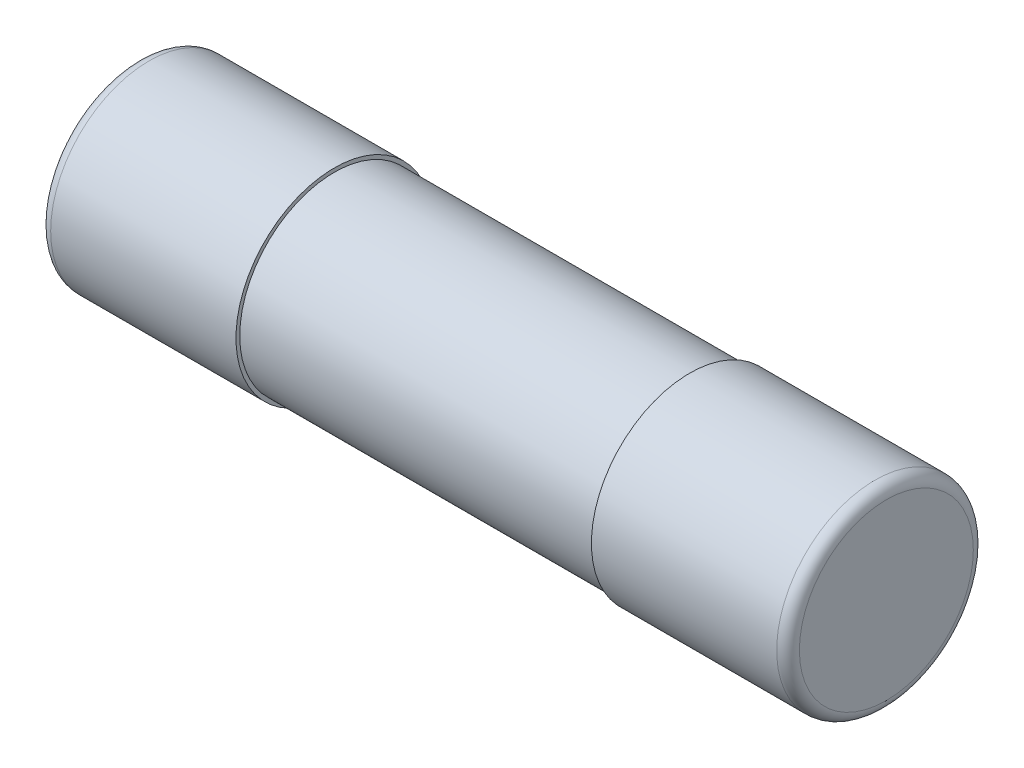
ISO-10303-21;
HEADER;
FILE_DESCRIPTION(('STEP AP214'),'2;1');
FILE_NAME('part.step','',(''),(''),'','','');
FILE_SCHEMA(('AUTOMOTIVE_DESIGN { 1 0 10303 214 1 1 1 1 }'));
ENDSEC;
DATA;
#1=APPLICATION_CONTEXT('core data for automotive mechanical design processes');
#2=APPLICATION_PROTOCOL_DEFINITION('international standard','automotive_design',2000,#1);
#3=PRODUCT_CONTEXT('',#1,'mechanical');
#4=PRODUCT('Part','Part','',(#3));
#5=PRODUCT_RELATED_PRODUCT_CATEGORY('part','',(#4));
#6=PRODUCT_DEFINITION_FORMATION('','',#4);
#7=PRODUCT_DEFINITION_CONTEXT('part definition',#1,'design');
#8=PRODUCT_DEFINITION('design','',#6,#7);
#9=PRODUCT_DEFINITION_SHAPE('','',#8);
#10=(LENGTH_UNIT() NAMED_UNIT(*) SI_UNIT(.MILLI.,.METRE.));
#11=(NAMED_UNIT(*) PLANE_ANGLE_UNIT() SI_UNIT($,.RADIAN.));
#12=(NAMED_UNIT(*) SI_UNIT($,.STERADIAN.) SOLID_ANGLE_UNIT());
#13=UNCERTAINTY_MEASURE_WITH_UNIT(LENGTH_MEASURE(1.E-05),#10,'distance_accuracy_value','');
#14=(GEOMETRIC_REPRESENTATION_CONTEXT(3) GLOBAL_UNCERTAINTY_ASSIGNED_CONTEXT((#13)) GLOBAL_UNIT_ASSIGNED_CONTEXT((#10,
#11,#12)) REPRESENTATION_CONTEXT('',''));
#15=CARTESIAN_POINT('',(0.,0.,0.));
#16=DIRECTION('',(0.,0.,1.));
#17=DIRECTION('',(1.,0.,0.));
#18=AXIS2_PLACEMENT_3D('',#15,#16,#17);
#19=CARTESIAN_POINT('',(4.7,0.,0.));
#20=DIRECTION('',(-1.,0.,0.));
#21=DIRECTION('',(0.,0.,1.));
#22=AXIS2_PLACEMENT_3D('',#19,#20,#21);
#23=CYLINDRICAL_SURFACE('',#22,2.5);
#24=CARTESIAN_POINT('',(4.7,0.,0.));
#25=DIRECTION('',(1.,0.,0.));
#26=DIRECTION('',(0.,0.,-1.));
#27=AXIS2_PLACEMENT_3D('',#24,#25,#26);
#28=CIRCLE('',#27,2.5);
#29=CARTESIAN_POINT('',(4.7,0.,-2.5));
#30=VERTEX_POINT('',#29);
#31=EDGE_CURVE('E50',#30,#30,#28,.T.);
#32=ORIENTED_EDGE('',*,*,#31,.F.);
#33=EDGE_LOOP('',(#32));
#34=FACE_BOUND('',#33,.T.);
#35=CARTESIAN_POINT('',(-4.7,0.,0.));
#36=DIRECTION('',(-1.,0.,0.));
#37=DIRECTION('',(0.,0.,1.));
#38=AXIS2_PLACEMENT_3D('',#35,#36,#37);
#39=CIRCLE('',#38,2.5);
#40=CARTESIAN_POINT('',(-4.7,0.,2.5));
#41=VERTEX_POINT('',#40);
#42=EDGE_CURVE('E56',#41,#41,#39,.T.);
#43=ORIENTED_EDGE('',*,*,#42,.F.);
#44=EDGE_LOOP('',(#43));
#45=FACE_BOUND('',#44,.T.);
#46=ADVANCED_FACE('F30',(#34,#45),#23,.T.);
#47=CARTESIAN_POINT('',(4.7,0.,0.));
#48=DIRECTION('',(1.,0.,0.));
#49=DIRECTION('',(0.,0.,-1.));
#50=AXIS2_PLACEMENT_3D('',#47,#48,#49);
#51=PLANE('',#50);
#52=CARTESIAN_POINT('',(4.7,0.,0.));
#53=DIRECTION('',(1.,0.,0.));
#54=DIRECTION('',(0.,0.,-1.));
#55=AXIS2_PLACEMENT_3D('',#52,#53,#54);
#56=CIRCLE('',#55,2.6);
#57=CARTESIAN_POINT('',(4.7,0.,-2.6));
#58=VERTEX_POINT('',#57);
#59=EDGE_CURVE('E53',#58,#58,#56,.T.);
#60=ORIENTED_EDGE('',*,*,#59,.F.);
#61=EDGE_LOOP('',(#60));
#62=FACE_BOUND('',#61,.T.);
#63=ORIENTED_EDGE('',*,*,#31,.T.);
#64=EDGE_LOOP('',(#63));
#65=FACE_BOUND('',#64,.T.);
#66=ADVANCED_FACE('F79',(#62,#65),#51,.F.);
#67=CARTESIAN_POINT('',(9.9,0.,0.));
#68=DIRECTION('',(-1.,0.,0.));
#69=DIRECTION('',(0.,0.,1.));
#70=AXIS2_PLACEMENT_3D('',#67,#68,#69);
#71=CYLINDRICAL_SURFACE('',#70,2.6);
#72=CARTESIAN_POINT('',(9.6,0.,0.));
#73=DIRECTION('',(1.,0.,0.));
#74=DIRECTION('',(0.,0.,-1.));
#75=AXIS2_PLACEMENT_3D('',#72,#73,#74);
#76=CIRCLE('',#75,2.6);
#77=CARTESIAN_POINT('',(9.6,0.,-2.6));
#78=VERTEX_POINT('',#77);
#79=EDGE_CURVE('E41',#78,#78,#76,.F.);
#80=ORIENTED_EDGE('',*,*,#79,.T.);
#81=EDGE_LOOP('',(#80));
#82=FACE_BOUND('',#81,.T.);
#83=ORIENTED_EDGE('',*,*,#59,.T.);
#84=EDGE_LOOP('',(#83));
#85=FACE_BOUND('',#84,.T.);
#86=ADVANCED_FACE('F85',(#82,#85),#71,.T.);
#87=CARTESIAN_POINT('',(9.9,0.,0.));
#88=DIRECTION('',(1.,0.,0.));
#89=DIRECTION('',(0.,0.,-1.));
#90=AXIS2_PLACEMENT_3D('',#87,#88,#89);
#91=PLANE('',#90);
#92=CARTESIAN_POINT('',(9.9,0.,0.));
#93=DIRECTION('',(1.,0.,0.));
#94=DIRECTION('',(0.,0.,-1.));
#95=AXIS2_PLACEMENT_3D('',#92,#93,#94);
#96=CIRCLE('',#95,2.3);
#97=CARTESIAN_POINT('',(9.9,0.,-2.3));
#98=VERTEX_POINT('',#97);
#99=EDGE_CURVE('E45',#98,#98,#96,.T.);
#100=ORIENTED_EDGE('',*,*,#99,.T.);
#101=EDGE_LOOP('',(#100));
#102=FACE_BOUND('',#101,.T.);
#103=ADVANCED_FACE('F92',(#102),#91,.T.);
#104=CARTESIAN_POINT('',(9.6,0.,0.));
#105=DIRECTION('',(1.,0.,0.));
#106=DIRECTION('',(0.,0.,-1.));
#107=AXIS2_PLACEMENT_3D('',#104,#105,#106);
#108=TOROIDAL_SURFACE('',#107,2.3,0.3);
#109=ORIENTED_EDGE('',*,*,#79,.F.);
#110=EDGE_LOOP('',(#109));
#111=FACE_BOUND('',#110,.T.);
#112=ORIENTED_EDGE('',*,*,#99,.F.);
#113=EDGE_LOOP('',(#112));
#114=FACE_BOUND('',#113,.T.);
#115=ADVANCED_FACE('F75',(#111,#114),#108,.T.);
#116=CARTESIAN_POINT('',(-4.7,0.,0.));
#117=DIRECTION('',(-1.,0.,0.));
#118=DIRECTION('',(0.,0.,-1.));
#119=AXIS2_PLACEMENT_3D('',#116,#117,#118);
#120=PLANE('',#119);
#121=CARTESIAN_POINT('',(-4.7,0.,0.));
#122=DIRECTION('',(1.,0.,0.));
#123=DIRECTION('',(0.,0.,-1.));
#124=AXIS2_PLACEMENT_3D('',#121,#122,#123);
#125=CIRCLE('',#124,2.6);
#126=CARTESIAN_POINT('',(-4.7,0.,-2.6));
#127=VERTEX_POINT('',#126);
#128=EDGE_CURVE('E59',#127,#127,#125,.T.);
#129=ORIENTED_EDGE('',*,*,#128,.T.);
#130=EDGE_LOOP('',(#129));
#131=FACE_BOUND('',#130,.T.);
#132=ORIENTED_EDGE('',*,*,#42,.T.);
#133=EDGE_LOOP('',(#132));
#134=FACE_BOUND('',#133,.T.);
#135=ADVANCED_FACE('F63',(#131,#134),#120,.F.);
#136=CARTESIAN_POINT('',(-9.9,0.,0.));
#137=DIRECTION('',(1.,0.,0.));
#138=DIRECTION('',(0.,0.,-1.));
#139=AXIS2_PLACEMENT_3D('',#136,#137,#138);
#140=CYLINDRICAL_SURFACE('',#139,2.6);
#141=CARTESIAN_POINT('',(-9.6,0.,0.));
#142=DIRECTION('',(-1.,0.,0.));
#143=DIRECTION('',(0.,0.,1.));
#144=AXIS2_PLACEMENT_3D('',#141,#142,#143);
#145=CIRCLE('',#144,2.6);
#146=CARTESIAN_POINT('',(-9.6,0.,2.6));
#147=VERTEX_POINT('',#146);
#148=EDGE_CURVE('E37',#147,#147,#145,.F.);
#149=ORIENTED_EDGE('',*,*,#148,.T.);
#150=EDGE_LOOP('',(#149));
#151=FACE_BOUND('',#150,.T.);
#152=ORIENTED_EDGE('',*,*,#128,.F.);
#153=EDGE_LOOP('',(#152));
#154=FACE_BOUND('',#153,.T.);
#155=ADVANCED_FACE('F66',(#151,#154),#140,.T.);
#156=CARTESIAN_POINT('',(-9.9,0.,0.));
#157=DIRECTION('',(-1.,0.,0.));
#158=DIRECTION('',(0.,0.,-1.));
#159=AXIS2_PLACEMENT_3D('',#156,#157,#158);
#160=PLANE('',#159);
#161=CARTESIAN_POINT('',(-9.9,0.,0.));
#162=DIRECTION('',(-1.,0.,0.));
#163=DIRECTION('',(0.,0.,1.));
#164=AXIS2_PLACEMENT_3D('',#161,#162,#163);
#165=CIRCLE('',#164,2.3);
#166=CARTESIAN_POINT('',(-9.9,0.,2.3));
#167=VERTEX_POINT('',#166);
#168=EDGE_CURVE('E10',#167,#167,#165,.T.);
#169=ORIENTED_EDGE('',*,*,#168,.T.);
#170=EDGE_LOOP('',(#169));
#171=FACE_BOUND('',#170,.T.);
#172=ADVANCED_FACE('F68',(#171),#160,.T.);
#173=CARTESIAN_POINT('',(-9.6,0.,0.));
#174=DIRECTION('',(-1.,0.,0.));
#175=DIRECTION('',(0.,0.,1.));
#176=AXIS2_PLACEMENT_3D('',#173,#174,#175);
#177=TOROIDAL_SURFACE('',#176,2.3,0.3);
#178=ORIENTED_EDGE('',*,*,#168,.F.);
#179=EDGE_LOOP('',(#178));
#180=FACE_BOUND('',#179,.T.);
#181=ORIENTED_EDGE('',*,*,#148,.F.);
#182=EDGE_LOOP('',(#181));
#183=FACE_BOUND('',#182,.T.);
#184=ADVANCED_FACE('F32',(#180,#183),#177,.T.);
#185=CLOSED_SHELL('',(#46,#66,#86,#103,#115,#135,#155,#172,#184));
#186=MANIFOLD_SOLID_BREP('B2',#185);
#187=ADVANCED_BREP_SHAPE_REPRESENTATION('',(#18,#186),#14);
#188=SHAPE_DEFINITION_REPRESENTATION(#9,#187);
ENDSEC;
END-ISO-10303-21;
